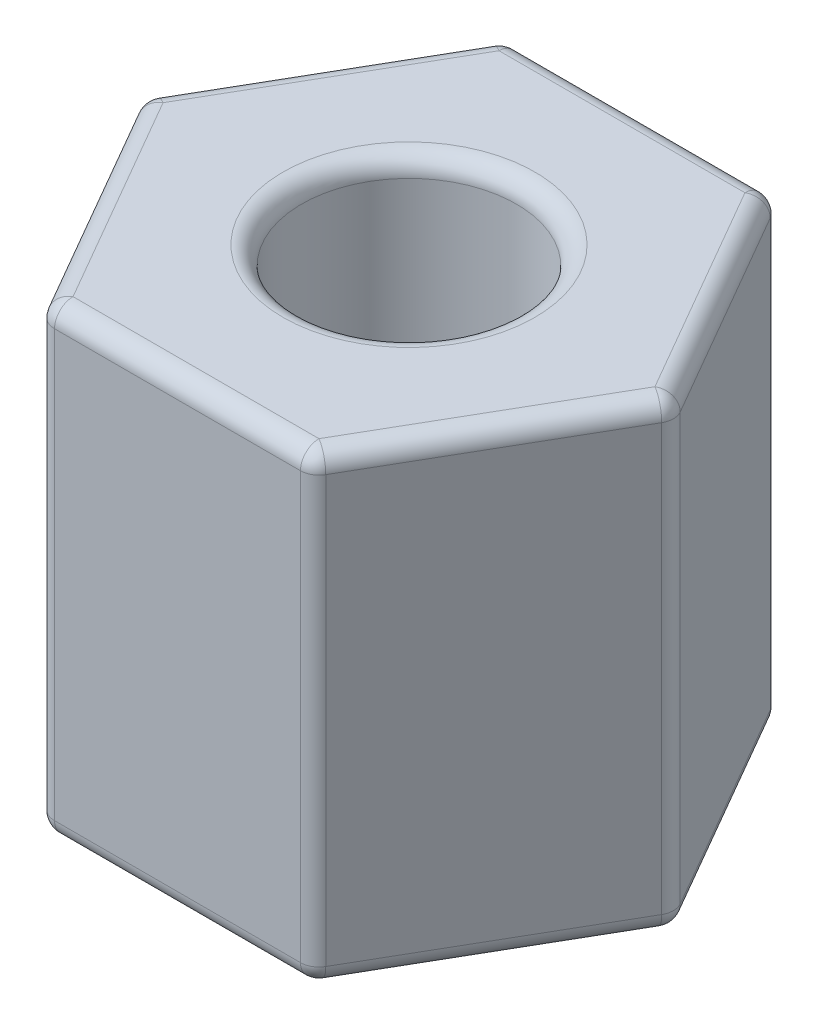
ISO-10303-21;
HEADER;
FILE_DESCRIPTION(('STEP AP214'),'2;1');
FILE_NAME('part.step','',(''),(''),'','','');
FILE_SCHEMA(('AUTOMOTIVE_DESIGN { 1 0 10303 214 1 1 1 1 }'));
ENDSEC;
DATA;
#1=APPLICATION_CONTEXT('core data for automotive mechanical design processes');
#2=APPLICATION_PROTOCOL_DEFINITION('international standard','automotive_design',2000,#1);
#3=PRODUCT_CONTEXT('',#1,'mechanical');
#4=PRODUCT('Part','Part','',(#3));
#5=PRODUCT_RELATED_PRODUCT_CATEGORY('part','',(#4));
#6=PRODUCT_DEFINITION_FORMATION('','',#4);
#7=PRODUCT_DEFINITION_CONTEXT('part definition',#1,'design');
#8=PRODUCT_DEFINITION('design','',#6,#7);
#9=PRODUCT_DEFINITION_SHAPE('','',#8);
#10=(LENGTH_UNIT() NAMED_UNIT(*) SI_UNIT(.MILLI.,.METRE.));
#11=(NAMED_UNIT(*) PLANE_ANGLE_UNIT() SI_UNIT($,.RADIAN.));
#12=(NAMED_UNIT(*) SI_UNIT($,.STERADIAN.) SOLID_ANGLE_UNIT());
#13=UNCERTAINTY_MEASURE_WITH_UNIT(LENGTH_MEASURE(1.E-05),#10,'distance_accuracy_value','');
#14=(GEOMETRIC_REPRESENTATION_CONTEXT(3) GLOBAL_UNCERTAINTY_ASSIGNED_CONTEXT((#13)) GLOBAL_UNIT_ASSIGNED_CONTEXT((#10,
#11,#12)) REPRESENTATION_CONTEXT('',''));
#15=CARTESIAN_POINT('',(0.,0.,0.));
#16=DIRECTION('',(0.,0.,1.));
#17=DIRECTION('',(1.,0.,0.));
#18=AXIS2_PLACEMENT_3D('',#15,#16,#17);
#19=CARTESIAN_POINT('',(0.,6.35,0.));
#20=DIRECTION('',(0.,1.,0.));
#21=DIRECTION('',(0.,0.,1.));
#22=AXIS2_PLACEMENT_3D('',#19,#20,#21);
#23=PLANE('',#22);
#24=CARTESIAN_POINT('',(0.,6.35,0.));
#25=DIRECTION('',(0.,1.,0.));
#26=DIRECTION('',(0.,0.,1.));
#27=AXIS2_PLACEMENT_3D('',#24,#25,#26);
#28=CIRCLE('',#27,1.7272);
#29=CARTESIAN_POINT('',(0.,6.35,1.7272));
#30=VERTEX_POINT('',#29);
#31=EDGE_CURVE('E229',#30,#30,#28,.F.);
#32=ORIENTED_EDGE('',*,*,#31,.T.);
#33=EDGE_LOOP('',(#32));
#34=FACE_BOUND('',#33,.T.);
#35=DIRECTION('',(0.5,0.,-0.866025403784439));
#36=VECTOR('',#35,1.);
#37=CARTESIAN_POINT('',(3.44620375679286,6.35,-0.126999999999994));
#38=LINE('',#37,#36);
#39=CARTESIAN_POINT('',(1.68644013630289,6.35,2.92099999999999));
#40=VERTEX_POINT('',#39);
#41=CARTESIAN_POINT('',(3.37288027260578,6.35,0.));
#42=VERTEX_POINT('',#41);
#43=EDGE_CURVE('E163',#40,#42,#38,.T.);
#44=ORIENTED_EDGE('',*,*,#43,.T.);
#45=DIRECTION('',(-0.5,0.,-0.866025403784439));
#46=VECTOR('',#45,1.);
#47=CARTESIAN_POINT('',(1.61311665211579,6.35,-3.04800000000001));
#48=LINE('',#47,#46);
#49=CARTESIAN_POINT('',(1.68644013630288,6.35,-2.92100000000001));
#50=VERTEX_POINT('',#49);
#51=EDGE_CURVE('E227',#42,#50,#48,.T.);
#52=ORIENTED_EDGE('',*,*,#51,.T.);
#53=DIRECTION('',(-1.,0.,0.));
#54=VECTOR('',#53,1.);
#55=CARTESIAN_POINT('',(-1.83308710467707,6.35,-2.92100000000001));
#56=LINE('',#55,#54);
#57=CARTESIAN_POINT('',(-1.6864401363029,6.35,-2.92100000000001));
#58=VERTEX_POINT('',#57);
#59=EDGE_CURVE('E225',#50,#58,#56,.T.);
#60=ORIENTED_EDGE('',*,*,#59,.T.);
#61=DIRECTION('',(-0.5,0.,0.866025403784439));
#62=VECTOR('',#61,1.);
#63=CARTESIAN_POINT('',(-3.44620375679288,6.35,0.126999999999989));
#64=LINE('',#63,#62);
#65=CARTESIAN_POINT('',(-3.3728802726058,6.35,0.));
#66=VERTEX_POINT('',#65);
#67=EDGE_CURVE('E223',#58,#66,#64,.T.);
#68=ORIENTED_EDGE('',*,*,#67,.T.);
#69=DIRECTION('',(0.5,0.,0.866025403784439));
#70=VECTOR('',#69,1.);
#71=CARTESIAN_POINT('',(-1.61311665211581,6.35,3.048));
#72=LINE('',#71,#70);
#73=CARTESIAN_POINT('',(-1.6864401363029,6.35,2.921));
#74=VERTEX_POINT('',#73);
#75=EDGE_CURVE('E166',#66,#74,#72,.T.);
#76=ORIENTED_EDGE('',*,*,#75,.T.);
#77=DIRECTION('',(1.,0.,0.));
#78=VECTOR('',#77,1.);
#79=CARTESIAN_POINT('',(1.83308710467706,6.35,2.92099999999999));
#80=LINE('',#79,#78);
#81=EDGE_CURVE('E160',#74,#40,#80,.T.);
#82=ORIENTED_EDGE('',*,*,#81,.T.);
#83=EDGE_LOOP('',(#44,#52,#60,#68,#76,#82));
#84=FACE_BOUND('',#83,.T.);
#85=ADVANCED_FACE('F33',(#34,#84),#23,.T.);
#86=CARTESIAN_POINT('',(0.,0.,0.));
#87=DIRECTION('',(0.,1.,0.));
#88=DIRECTION('',(0.,0.,1.));
#89=AXIS2_PLACEMENT_3D('',#86,#87,#88);
#90=PLANE('',#89);
#91=CARTESIAN_POINT('',(0.,0.,0.));
#92=DIRECTION('',(0.,1.,0.));
#93=DIRECTION('',(0.,0.,1.));
#94=AXIS2_PLACEMENT_3D('',#91,#92,#93);
#95=CIRCLE('',#94,1.7272);
#96=CARTESIAN_POINT('',(0.,0.,1.7272));
#97=VERTEX_POINT('',#96);
#98=EDGE_CURVE('E245',#97,#97,#95,.T.);
#99=ORIENTED_EDGE('',*,*,#98,.T.);
#100=EDGE_LOOP('',(#99));
#101=FACE_BOUND('',#100,.T.);
#102=DIRECTION('',(0.5,0.,0.866025403784439));
#103=VECTOR('',#102,1.);
#104=CARTESIAN_POINT('',(-2.52966020445434,0.,1.4605));
#105=LINE('',#104,#103);
#106=CARTESIAN_POINT('',(-1.6864401363029,0.,2.921));
#107=VERTEX_POINT('',#106);
#108=CARTESIAN_POINT('',(-3.3728802726058,0.,0.));
#109=VERTEX_POINT('',#108);
#110=EDGE_CURVE('E232',#107,#109,#105,.F.);
#111=ORIENTED_EDGE('',*,*,#110,.T.);
#112=DIRECTION('',(-0.5,0.,0.866025403784439));
#113=VECTOR('',#112,1.);
#114=CARTESIAN_POINT('',(-2.52966020445435,0.,-1.46050000000001));
#115=LINE('',#114,#113);
#116=CARTESIAN_POINT('',(-1.6864401363029,0.,-2.92100000000001));
#117=VERTEX_POINT('',#116);
#118=EDGE_CURVE('E242',#109,#117,#115,.F.);
#119=ORIENTED_EDGE('',*,*,#118,.T.);
#120=DIRECTION('',(-1.,0.,0.));
#121=VECTOR('',#120,1.);
#122=CARTESIAN_POINT('',(0.,0.,-2.92100000000001));
#123=LINE('',#122,#121);
#124=CARTESIAN_POINT('',(1.68644013630288,0.,-2.92100000000001));
#125=VERTEX_POINT('',#124);
#126=EDGE_CURVE('E240',#117,#125,#123,.F.);
#127=ORIENTED_EDGE('',*,*,#126,.T.);
#128=DIRECTION('',(-0.5,0.,-0.866025403784439));
#129=VECTOR('',#128,1.);
#130=CARTESIAN_POINT('',(2.52966020445433,0.,-1.46049999999999));
#131=LINE('',#130,#129);
#132=CARTESIAN_POINT('',(3.37288027260578,0.,0.));
#133=VERTEX_POINT('',#132);
#134=EDGE_CURVE('E238',#125,#133,#131,.F.);
#135=ORIENTED_EDGE('',*,*,#134,.T.);
#136=DIRECTION('',(0.5,0.,-0.866025403784439));
#137=VECTOR('',#136,1.);
#138=CARTESIAN_POINT('',(2.52966020445434,0.,1.4605));
#139=LINE('',#138,#137);
#140=CARTESIAN_POINT('',(1.68644013630289,0.,2.92099999999999));
#141=VERTEX_POINT('',#140);
#142=EDGE_CURVE('E236',#133,#141,#139,.F.);
#143=ORIENTED_EDGE('',*,*,#142,.T.);
#144=DIRECTION('',(1.,0.,0.));
#145=VECTOR('',#144,1.);
#146=CARTESIAN_POINT('',(0.,0.,2.921));
#147=LINE('',#146,#145);
#148=EDGE_CURVE('E234',#141,#107,#147,.F.);
#149=ORIENTED_EDGE('',*,*,#148,.T.);
#150=EDGE_LOOP('',(#111,#119,#127,#135,#143,#149));
#151=FACE_BOUND('',#150,.T.);
#152=ADVANCED_FACE('F429',(#101,#151),#90,.F.);
#153=CARTESIAN_POINT('',(-1.83308710467706,6.35,3.175));
#154=DIRECTION('',(0.,0.,-1.));
#155=DIRECTION('',(-1.,0.,0.));
#156=AXIS2_PLACEMENT_3D('',#153,#154,#155);
#157=PLANE('',#156);
#158=DIRECTION('',(0.,-1.,0.));
#159=VECTOR('',#158,1.);
#160=CARTESIAN_POINT('',(-1.6864401363029,6.35,3.175));
#161=LINE('',#160,#159);
#162=CARTESIAN_POINT('',(-1.6864401363029,6.096,3.175));
#163=VERTEX_POINT('',#162);
#164=CARTESIAN_POINT('',(-1.6864401363029,0.254,3.175));
#165=VERTEX_POINT('',#164);
#166=EDGE_CURVE('E284',#163,#165,#161,.T.);
#167=ORIENTED_EDGE('',*,*,#166,.T.);
#168=DIRECTION('',(1.,0.,0.));
#169=VECTOR('',#168,1.);
#170=CARTESIAN_POINT('',(-1.83308710467706,0.254,3.175));
#171=LINE('',#170,#169);
#172=CARTESIAN_POINT('',(1.68644013630289,0.254,3.17499999999999));
#173=VERTEX_POINT('',#172);
#174=EDGE_CURVE('E286',#165,#173,#171,.T.);
#175=ORIENTED_EDGE('',*,*,#174,.T.);
#176=DIRECTION('',(0.,-1.,0.));
#177=VECTOR('',#176,1.);
#178=CARTESIAN_POINT('',(1.68644013630289,6.35,3.17499999999999));
#179=LINE('',#178,#177);
#180=CARTESIAN_POINT('',(1.68644013630289,6.096,3.17499999999999));
#181=VERTEX_POINT('',#180);
#182=EDGE_CURVE('E282',#173,#181,#179,.F.);
#183=ORIENTED_EDGE('',*,*,#182,.T.);
#184=DIRECTION('',(1.,0.,0.));
#185=VECTOR('',#184,1.);
#186=CARTESIAN_POINT('',(-1.83308710467706,6.096,3.175));
#187=LINE('',#186,#185);
#188=EDGE_CURVE('E192',#181,#163,#187,.F.);
#189=ORIENTED_EDGE('',*,*,#188,.T.);
#190=EDGE_LOOP('',(#167,#175,#183,#189));
#191=FACE_BOUND('',#190,.T.);
#192=ADVANCED_FACE('F466',(#191),#157,.F.);
#193=CARTESIAN_POINT('',(1.83308710467706,6.35,3.17499999999999));
#194=DIRECTION('',(-0.866025403784439,0.,-0.5));
#195=DIRECTION('',(-0.5,0.,0.866025403784439));
#196=AXIS2_PLACEMENT_3D('',#193,#194,#195);
#197=PLANE('',#196);
#198=DIRECTION('',(0.,-1.,0.));
#199=VECTOR('',#198,1.);
#200=CARTESIAN_POINT('',(1.90641058886414,6.35,3.04799999999999));
#201=LINE('',#200,#199);
#202=CARTESIAN_POINT('',(1.90641058886414,6.096,3.04799999999999));
#203=VERTEX_POINT('',#202);
#204=CARTESIAN_POINT('',(1.90641058886414,0.254,3.04799999999999));
#205=VERTEX_POINT('',#204);
#206=EDGE_CURVE('E276',#203,#205,#201,.T.);
#207=ORIENTED_EDGE('',*,*,#206,.T.);
#208=DIRECTION('',(0.5,0.,-0.866025403784439));
#209=VECTOR('',#208,1.);
#210=CARTESIAN_POINT('',(1.83308710467706,0.254,3.17499999999999));
#211=LINE('',#210,#209);
#212=CARTESIAN_POINT('',(3.59285072516703,0.254,0.127000000000007));
#213=VERTEX_POINT('',#212);
#214=EDGE_CURVE('E279',#205,#213,#211,.T.);
#215=ORIENTED_EDGE('',*,*,#214,.T.);
#216=DIRECTION('',(0.,-1.,0.));
#217=VECTOR('',#216,1.);
#218=CARTESIAN_POINT('',(3.59285072516703,6.35,0.127000000000006));
#219=LINE('',#218,#217);
#220=CARTESIAN_POINT('',(3.59285072516703,6.096,0.127000000000007));
#221=VERTEX_POINT('',#220);
#222=EDGE_CURVE('E208',#213,#221,#219,.F.);
#223=ORIENTED_EDGE('',*,*,#222,.T.);
#224=DIRECTION('',(0.5,0.,-0.866025403784439));
#225=VECTOR('',#224,1.);
#226=CARTESIAN_POINT('',(1.83308710467706,6.096,3.17499999999999));
#227=LINE('',#226,#225);
#228=EDGE_CURVE('E274',#221,#203,#227,.F.);
#229=ORIENTED_EDGE('',*,*,#228,.T.);
#230=EDGE_LOOP('',(#207,#215,#223,#229));
#231=FACE_BOUND('',#230,.T.);
#232=ADVANCED_FACE('F605',(#231),#197,.F.);
#233=CARTESIAN_POINT('',(3.66617420935411,6.35,0.));
#234=DIRECTION('',(-0.866025403784439,0.,0.5));
#235=DIRECTION('',(0.5,0.,0.866025403784439));
#236=AXIS2_PLACEMENT_3D('',#233,#234,#235);
#237=PLANE('',#236);
#238=DIRECTION('',(0.,-1.,0.));
#239=VECTOR('',#238,1.);
#240=CARTESIAN_POINT('',(3.59285072516703,6.35,-0.126999999999994));
#241=LINE('',#240,#239);
#242=CARTESIAN_POINT('',(3.59285072516703,6.096,-0.126999999999994));
#243=VERTEX_POINT('',#242);
#244=CARTESIAN_POINT('',(3.59285072516703,0.254,-0.126999999999994));
#245=VERTEX_POINT('',#244);
#246=EDGE_CURVE('E210',#243,#245,#241,.T.);
#247=ORIENTED_EDGE('',*,*,#246,.T.);
#248=DIRECTION('',(-0.5,0.,-0.866025403784439));
#249=VECTOR('',#248,1.);
#250=CARTESIAN_POINT('',(3.66617420935411,0.254,0.));
#251=LINE('',#250,#249);
#252=CARTESIAN_POINT('',(1.90641058886412,0.254,-3.04800000000001));
#253=VERTEX_POINT('',#252);
#254=EDGE_CURVE('E271',#245,#253,#251,.T.);
#255=ORIENTED_EDGE('',*,*,#254,.T.);
#256=DIRECTION('',(0.,-1.,0.));
#257=VECTOR('',#256,1.);
#258=CARTESIAN_POINT('',(1.90641058886412,6.35,-3.04800000000001));
#259=LINE('',#258,#257);
#260=CARTESIAN_POINT('',(1.90641058886412,6.096,-3.04800000000001));
#261=VERTEX_POINT('',#260);
#262=EDGE_CURVE('E269',#253,#261,#259,.F.);
#263=ORIENTED_EDGE('',*,*,#262,.T.);
#264=DIRECTION('',(-0.5,0.,-0.866025403784439));
#265=VECTOR('',#264,1.);
#266=CARTESIAN_POINT('',(3.66617420935411,6.096,0.));
#267=LINE('',#266,#265);
#268=EDGE_CURVE('E266',#261,#243,#267,.F.);
#269=ORIENTED_EDGE('',*,*,#268,.T.);
#270=EDGE_LOOP('',(#247,#255,#263,#269));
#271=FACE_BOUND('',#270,.T.);
#272=ADVANCED_FACE('F384',(#271),#237,.F.);
#273=CARTESIAN_POINT('',(1.83308710467704,6.35,-3.17500000000001));
#274=DIRECTION('',(0.,0.,1.));
#275=DIRECTION('',(1.,0.,0.));
#276=AXIS2_PLACEMENT_3D('',#273,#274,#275);
#277=PLANE('',#276);
#278=DIRECTION('',(0.,-1.,0.));
#279=VECTOR('',#278,1.);
#280=CARTESIAN_POINT('',(1.68644013630288,6.35,-3.17500000000001));
#281=LINE('',#280,#279);
#282=CARTESIAN_POINT('',(1.68644013630288,6.096,-3.17500000000001));
#283=VERTEX_POINT('',#282);
#284=CARTESIAN_POINT('',(1.68644013630288,0.254,-3.17500000000001));
#285=VERTEX_POINT('',#284);
#286=EDGE_CURVE('E259',#283,#285,#281,.T.);
#287=ORIENTED_EDGE('',*,*,#286,.T.);
#288=DIRECTION('',(-1.,0.,0.));
#289=VECTOR('',#288,1.);
#290=CARTESIAN_POINT('',(1.83308710467704,0.254,-3.17500000000001));
#291=LINE('',#290,#289);
#292=CARTESIAN_POINT('',(-1.6864401363029,0.254,-3.17500000000001));
#293=VERTEX_POINT('',#292);
#294=EDGE_CURVE('E263',#285,#293,#291,.T.);
#295=ORIENTED_EDGE('',*,*,#294,.T.);
#296=DIRECTION('',(0.,-1.,0.));
#297=VECTOR('',#296,1.);
#298=CARTESIAN_POINT('',(-1.6864401363029,6.35,-3.17500000000001));
#299=LINE('',#298,#297);
#300=CARTESIAN_POINT('',(-1.6864401363029,6.096,-3.17500000000001));
#301=VERTEX_POINT('',#300);
#302=EDGE_CURVE('E261',#293,#301,#299,.F.);
#303=ORIENTED_EDGE('',*,*,#302,.T.);
#304=DIRECTION('',(-1.,0.,0.));
#305=VECTOR('',#304,1.);
#306=CARTESIAN_POINT('',(1.83308710467704,6.096,-3.17500000000001));
#307=LINE('',#306,#305);
#308=EDGE_CURVE('E257',#301,#283,#307,.F.);
#309=ORIENTED_EDGE('',*,*,#308,.T.);
#310=EDGE_LOOP('',(#287,#295,#303,#309));
#311=FACE_BOUND('',#310,.T.);
#312=ADVANCED_FACE('F457',(#311),#277,.F.);
#313=CARTESIAN_POINT('',(-1.83308710467707,6.35,-3.17500000000001));
#314=DIRECTION('',(0.866025403784439,0.,0.5));
#315=DIRECTION('',(0.5,0.,-0.866025403784439));
#316=AXIS2_PLACEMENT_3D('',#313,#314,#315);
#317=PLANE('',#316);
#318=DIRECTION('',(0.,-1.,0.));
#319=VECTOR('',#318,1.);
#320=CARTESIAN_POINT('',(-1.90641058886415,6.35,-3.04800000000001));
#321=LINE('',#320,#319);
#322=CARTESIAN_POINT('',(-1.90641058886415,6.096,-3.04800000000001));
#323=VERTEX_POINT('',#322);
#324=CARTESIAN_POINT('',(-1.90641058886415,0.254,-3.04800000000001));
#325=VERTEX_POINT('',#324);
#326=EDGE_CURVE('E250',#323,#325,#321,.T.);
#327=ORIENTED_EDGE('',*,*,#326,.T.);
#328=DIRECTION('',(-0.5,0.,0.866025403784439));
#329=VECTOR('',#328,1.);
#330=CARTESIAN_POINT('',(-1.83308710467707,0.254,-3.17500000000001));
#331=LINE('',#330,#329);
#332=CARTESIAN_POINT('',(-3.59285072516705,0.254,-0.127000000000011));
#333=VERTEX_POINT('',#332);
#334=EDGE_CURVE('E254',#325,#333,#331,.T.);
#335=ORIENTED_EDGE('',*,*,#334,.T.);
#336=DIRECTION('',(0.,-1.,0.));
#337=VECTOR('',#336,1.);
#338=CARTESIAN_POINT('',(-3.59285072516705,6.35,-0.127000000000011));
#339=LINE('',#338,#337);
#340=CARTESIAN_POINT('',(-3.59285072516705,6.096,-0.127000000000011));
#341=VERTEX_POINT('',#340);
#342=EDGE_CURVE('E252',#333,#341,#339,.F.);
#343=ORIENTED_EDGE('',*,*,#342,.T.);
#344=DIRECTION('',(-0.5,0.,0.866025403784439));
#345=VECTOR('',#344,1.);
#346=CARTESIAN_POINT('',(-1.83308710467707,6.096,-3.17500000000001));
#347=LINE('',#346,#345);
#348=EDGE_CURVE('E248',#341,#323,#347,.F.);
#349=ORIENTED_EDGE('',*,*,#348,.T.);
#350=EDGE_LOOP('',(#327,#335,#343,#349));
#351=FACE_BOUND('',#350,.T.);
#352=ADVANCED_FACE('F410',(#351),#317,.F.);
#353=CARTESIAN_POINT('',(-3.66617420935413,6.35,0.));
#354=DIRECTION('',(0.866025403784438,0.,-0.5));
#355=DIRECTION('',(-0.5,0.,-0.866025403784439));
#356=AXIS2_PLACEMENT_3D('',#353,#354,#355);
#357=PLANE('',#356);
#358=DIRECTION('',(0.,-1.,0.));
#359=VECTOR('',#358,1.);
#360=CARTESIAN_POINT('',(-3.59285072516705,6.35,0.126999999999989));
#361=LINE('',#360,#359);
#362=CARTESIAN_POINT('',(-3.59285072516705,6.096,0.126999999999989));
#363=VERTEX_POINT('',#362);
#364=CARTESIAN_POINT('',(-3.59285072516705,0.254,0.126999999999989));
#365=VERTEX_POINT('',#364);
#366=EDGE_CURVE('E57',#363,#365,#361,.T.);
#367=ORIENTED_EDGE('',*,*,#366,.T.);
#368=DIRECTION('',(0.5,0.,0.866025403784439));
#369=VECTOR('',#368,1.);
#370=CARTESIAN_POINT('',(-3.66617420935413,0.254,0.));
#371=LINE('',#370,#369);
#372=CARTESIAN_POINT('',(-1.90641058886414,0.254,3.048));
#373=VERTEX_POINT('',#372);
#374=EDGE_CURVE('E11',#365,#373,#371,.T.);
#375=ORIENTED_EDGE('',*,*,#374,.T.);
#376=DIRECTION('',(0.,-1.,0.));
#377=VECTOR('',#376,1.);
#378=CARTESIAN_POINT('',(-1.90641058886414,6.35,3.048));
#379=LINE('',#378,#377);
#380=CARTESIAN_POINT('',(-1.90641058886414,6.096,3.048));
#381=VERTEX_POINT('',#380);
#382=EDGE_CURVE('E42',#373,#381,#379,.F.);
#383=ORIENTED_EDGE('',*,*,#382,.T.);
#384=DIRECTION('',(0.5,0.,0.866025403784439));
#385=VECTOR('',#384,1.);
#386=CARTESIAN_POINT('',(-3.66617420935413,6.096,0.));
#387=LINE('',#386,#385);
#388=EDGE_CURVE('E289',#381,#363,#387,.F.);
#389=ORIENTED_EDGE('',*,*,#388,.T.);
#390=EDGE_LOOP('',(#367,#375,#383,#389));
#391=FACE_BOUND('',#390,.T.);
#392=ADVANCED_FACE('F446',(#391),#357,.F.);
#393=CARTESIAN_POINT('',(0.,6.35,0.));
#394=DIRECTION('',(0.,-1.,0.));
#395=DIRECTION('',(0.,0.,-1.));
#396=AXIS2_PLACEMENT_3D('',#393,#394,#395);
#397=CYLINDRICAL_SURFACE('',#396,1.4732);
#398=CARTESIAN_POINT('',(0.,6.096,0.));
#399=DIRECTION('',(0.,1.,0.));
#400=DIRECTION('',(0.,0.,1.));
#401=AXIS2_PLACEMENT_3D('',#398,#399,#400);
#402=CIRCLE('',#401,1.4732);
#403=CARTESIAN_POINT('',(0.,6.096,1.4732));
#404=VERTEX_POINT('',#403);
#405=EDGE_CURVE('E180',#404,#404,#402,.T.);
#406=ORIENTED_EDGE('',*,*,#405,.T.);
#407=EDGE_LOOP('',(#406));
#408=FACE_BOUND('',#407,.T.);
#409=CARTESIAN_POINT('',(0.,0.254,0.));
#410=DIRECTION('',(0.,1.,0.));
#411=DIRECTION('',(0.,0.,1.));
#412=AXIS2_PLACEMENT_3D('',#409,#410,#411);
#413=CIRCLE('',#412,1.4732);
#414=CARTESIAN_POINT('',(0.,0.254,1.4732));
#415=VERTEX_POINT('',#414);
#416=EDGE_CURVE('E214',#415,#415,#413,.F.);
#417=ORIENTED_EDGE('',*,*,#416,.T.);
#418=EDGE_LOOP('',(#417));
#419=FACE_BOUND('',#418,.T.);
#420=ADVANCED_FACE('F448',(#408,#419),#397,.F.);
#421=CARTESIAN_POINT('',(0.,6.096,0.));
#422=DIRECTION('',(0.,1.,0.));
#423=DIRECTION('',(0.,0.,1.));
#424=AXIS2_PLACEMENT_3D('',#421,#422,#423);
#425=TOROIDAL_SURFACE('',#424,1.7272,0.254);
#426=ORIENTED_EDGE('',*,*,#31,.F.);
#427=EDGE_LOOP('',(#426));
#428=FACE_BOUND('',#427,.T.);
#429=ORIENTED_EDGE('',*,*,#405,.F.);
#430=EDGE_LOOP('',(#429));
#431=FACE_BOUND('',#430,.T.);
#432=ADVANCED_FACE('F454',(#428,#431),#425,.T.);
#433=CARTESIAN_POINT('',(0.,0.254,0.));
#434=DIRECTION('',(0.,1.,0.));
#435=DIRECTION('',(0.,0.,1.));
#436=AXIS2_PLACEMENT_3D('',#433,#434,#435);
#437=TOROIDAL_SURFACE('',#436,1.7272,0.254);
#438=ORIENTED_EDGE('',*,*,#416,.F.);
#439=EDGE_LOOP('',(#438));
#440=FACE_BOUND('',#439,.T.);
#441=ORIENTED_EDGE('',*,*,#98,.F.);
#442=EDGE_LOOP('',(#441));
#443=FACE_BOUND('',#442,.T.);
#444=ADVANCED_FACE('F472',(#440,#443),#437,.T.);
#445=CARTESIAN_POINT('',(2.52966020445434,6.096,1.4605));
#446=DIRECTION('',(-0.5,0.,0.866025403784439));
#447=DIRECTION('',(0.866025403784439,0.,0.5));
#448=AXIS2_PLACEMENT_3D('',#445,#446,#447);
#449=CYLINDRICAL_SURFACE('',#448,0.254);
#450=CARTESIAN_POINT('',(3.37288027260578,6.096,0.));
#451=DIRECTION('',(0.499999999999999,0.,-0.866025403784439));
#452=DIRECTION('',(-0.866025403784439,0.,-0.499999999999999));
#453=AXIS2_PLACEMENT_3D('',#450,#451,#452);
#454=CIRCLE('',#453,0.254);
#455=EDGE_CURVE('E37',#42,#221,#454,.T.);
#456=ORIENTED_EDGE('',*,*,#455,.F.);
#457=ORIENTED_EDGE('',*,*,#43,.F.);
#458=CARTESIAN_POINT('',(1.68644013630289,6.096,2.92099999999999));
#459=DIRECTION('',(-0.5,0.,0.866025403784439));
#460=DIRECTION('',(0.866025403784439,0.,0.5));
#461=AXIS2_PLACEMENT_3D('',#458,#459,#460);
#462=CIRCLE('',#461,0.254);
#463=EDGE_CURVE('E176',#203,#40,#462,.T.);
#464=ORIENTED_EDGE('',*,*,#463,.F.);
#465=ORIENTED_EDGE('',*,*,#228,.F.);
#466=EDGE_LOOP('',(#456,#457,#464,#465));
#467=FACE_BOUND('',#466,.T.);
#468=ADVANCED_FACE('F35',(#467),#449,.T.);
#469=CARTESIAN_POINT('',(3.37288027260578,6.096,0.));
#470=DIRECTION('',(0.,0.,1.));
#471=DIRECTION('',(1.,0.,0.));
#472=AXIS2_PLACEMENT_3D('',#469,#470,#471);
#473=SPHERICAL_SURFACE('',#472,0.254);
#474=CARTESIAN_POINT('',(3.37288027260578,6.096,0.));
#475=DIRECTION('',(0.5,0.,0.866025403784439));
#476=DIRECTION('',(0.866025403784439,0.,-0.5));
#477=AXIS2_PLACEMENT_3D('',#474,#475,#476);
#478=CIRCLE('',#477,0.254);
#479=EDGE_CURVE('E193',#42,#243,#478,.F.);
#480=ORIENTED_EDGE('',*,*,#479,.F.);
#481=ORIENTED_EDGE('',*,*,#455,.T.);
#482=CARTESIAN_POINT('',(3.37288027260578,6.096,0.));
#483=DIRECTION('',(0.,1.,0.));
#484=DIRECTION('',(0.,0.,1.));
#485=AXIS2_PLACEMENT_3D('',#482,#483,#484);
#486=CIRCLE('',#485,0.254);
#487=EDGE_CURVE('E190',#243,#221,#486,.F.);
#488=ORIENTED_EDGE('',*,*,#487,.F.);
#489=EDGE_LOOP('',(#480,#481,#488));
#490=FACE_BOUND('',#489,.T.);
#491=ADVANCED_FACE('F212',(#490),#473,.T.);
#492=CARTESIAN_POINT('',(1.68644013630289,6.096,2.92099999999999));
#493=DIRECTION('',(0.,0.,1.));
#494=DIRECTION('',(1.,0.,0.));
#495=AXIS2_PLACEMENT_3D('',#492,#493,#494);
#496=SPHERICAL_SURFACE('',#495,0.254);
#497=CARTESIAN_POINT('',(1.68644013630289,6.096,2.92099999999999));
#498=DIRECTION('',(0.,1.,0.));
#499=DIRECTION('',(0.,0.,1.));
#500=AXIS2_PLACEMENT_3D('',#497,#498,#499);
#501=CIRCLE('',#500,0.254);
#502=EDGE_CURVE('E188',#203,#181,#501,.F.);
#503=ORIENTED_EDGE('',*,*,#502,.F.);
#504=ORIENTED_EDGE('',*,*,#463,.T.);
#505=CARTESIAN_POINT('',(1.68644013630289,6.096,2.92099999999999));
#506=DIRECTION('',(1.,0.,0.));
#507=DIRECTION('',(0.,0.,-1.));
#508=AXIS2_PLACEMENT_3D('',#505,#506,#507);
#509=CIRCLE('',#508,0.254);
#510=EDGE_CURVE('E185',#181,#40,#509,.F.);
#511=ORIENTED_EDGE('',*,*,#510,.F.);
#512=EDGE_LOOP('',(#503,#504,#511));
#513=FACE_BOUND('',#512,.T.);
#514=ADVANCED_FACE('F184',(#513),#496,.T.);
#515=CARTESIAN_POINT('',(3.37288027260578,6.35,0.));
#516=DIRECTION('',(0.,-1.,0.));
#517=DIRECTION('',(0.,0.,-1.));
#518=AXIS2_PLACEMENT_3D('',#515,#516,#517);
#519=CYLINDRICAL_SURFACE('',#518,0.254);
#520=ORIENTED_EDGE('',*,*,#487,.T.);
#521=ORIENTED_EDGE('',*,*,#222,.F.);
#522=CARTESIAN_POINT('',(3.37288027260578,0.254,0.));
#523=DIRECTION('',(0.,-1.,0.));
#524=DIRECTION('',(0.,0.,-1.));
#525=AXIS2_PLACEMENT_3D('',#522,#523,#524);
#526=CIRCLE('',#525,0.254);
#527=EDGE_CURVE('E368',#245,#213,#526,.T.);
#528=ORIENTED_EDGE('',*,*,#527,.F.);
#529=ORIENTED_EDGE('',*,*,#246,.F.);
#530=EDGE_LOOP('',(#520,#521,#528,#529));
#531=FACE_BOUND('',#530,.T.);
#532=ADVANCED_FACE('F206',(#531),#519,.T.);
#533=CARTESIAN_POINT('',(2.52966020445433,6.096,-1.46049999999999));
#534=DIRECTION('',(0.5,0.,0.866025403784439));
#535=DIRECTION('',(0.866025403784439,0.,-0.5));
#536=AXIS2_PLACEMENT_3D('',#533,#534,#535);
#537=CYLINDRICAL_SURFACE('',#536,0.254);
#538=ORIENTED_EDGE('',*,*,#479,.T.);
#539=ORIENTED_EDGE('',*,*,#268,.F.);
#540=CARTESIAN_POINT('',(1.68644013630288,6.096,-2.92100000000001));
#541=DIRECTION('',(-0.5,0.,-0.866025403784439));
#542=DIRECTION('',(-0.866025403784439,0.,0.5));
#543=AXIS2_PLACEMENT_3D('',#540,#541,#542);
#544=CIRCLE('',#543,0.254);
#545=EDGE_CURVE('E365',#50,#261,#544,.T.);
#546=ORIENTED_EDGE('',*,*,#545,.F.);
#547=ORIENTED_EDGE('',*,*,#51,.F.);
#548=EDGE_LOOP('',(#538,#539,#546,#547));
#549=FACE_BOUND('',#548,.T.);
#550=ADVANCED_FACE('F388',(#549),#537,.T.);
#551=CARTESIAN_POINT('',(0.,6.096,2.921));
#552=DIRECTION('',(-1.,0.,0.));
#553=DIRECTION('',(0.,0.,1.));
#554=AXIS2_PLACEMENT_3D('',#551,#552,#553);
#555=CYLINDRICAL_SURFACE('',#554,0.254);
#556=ORIENTED_EDGE('',*,*,#510,.T.);
#557=ORIENTED_EDGE('',*,*,#81,.F.);
#558=CARTESIAN_POINT('',(-1.6864401363029,6.096,2.921));
#559=DIRECTION('',(-1.,0.,0.));
#560=DIRECTION('',(0.,-1.,0.));
#561=AXIS2_PLACEMENT_3D('',#558,#559,#560);
#562=CIRCLE('',#561,0.254);
#563=EDGE_CURVE('E363',#163,#74,#562,.T.);
#564=ORIENTED_EDGE('',*,*,#563,.F.);
#565=ORIENTED_EDGE('',*,*,#188,.F.);
#566=EDGE_LOOP('',(#556,#557,#564,#565));
#567=FACE_BOUND('',#566,.T.);
#568=ADVANCED_FACE('F191',(#567),#555,.T.);
#569=CARTESIAN_POINT('',(1.68644013630289,6.35,2.92099999999999));
#570=DIRECTION('',(0.,-1.,0.));
#571=DIRECTION('',(0.,0.,-1.));
#572=AXIS2_PLACEMENT_3D('',#569,#570,#571);
#573=CYLINDRICAL_SURFACE('',#572,0.254);
#574=ORIENTED_EDGE('',*,*,#502,.T.);
#575=ORIENTED_EDGE('',*,*,#182,.F.);
#576=CARTESIAN_POINT('',(1.68644013630289,0.254,2.92099999999999));
#577=DIRECTION('',(0.,-1.,0.));
#578=DIRECTION('',(0.,0.,-1.));
#579=AXIS2_PLACEMENT_3D('',#576,#577,#578);
#580=CIRCLE('',#579,0.254);
#581=EDGE_CURVE('E360',#205,#173,#580,.T.);
#582=ORIENTED_EDGE('',*,*,#581,.F.);
#583=ORIENTED_EDGE('',*,*,#206,.F.);
#584=EDGE_LOOP('',(#574,#575,#582,#583));
#585=FACE_BOUND('',#584,.T.);
#586=ADVANCED_FACE('F546',(#585),#573,.T.);
#587=CARTESIAN_POINT('',(1.61311665211581,0.254,3.04799999999999));
#588=DIRECTION('',(0.5,0.,-0.866025403784439));
#589=DIRECTION('',(-0.866025403784439,0.,-0.5));
#590=AXIS2_PLACEMENT_3D('',#587,#588,#589);
#591=CYLINDRICAL_SURFACE('',#590,0.254);
#592=CARTESIAN_POINT('',(3.37288027260578,0.254,0.));
#593=DIRECTION('',(0.5,0.,-0.866025403784439));
#594=DIRECTION('',(-0.866025403784439,0.,-0.5));
#595=AXIS2_PLACEMENT_3D('',#592,#593,#594);
#596=CIRCLE('',#595,0.254);
#597=EDGE_CURVE('E197',#213,#133,#596,.T.);
#598=ORIENTED_EDGE('',*,*,#597,.F.);
#599=ORIENTED_EDGE('',*,*,#214,.F.);
#600=CARTESIAN_POINT('',(1.68644013630289,0.254,2.92099999999999));
#601=DIRECTION('',(-0.5,0.,0.866025403784439));
#602=DIRECTION('',(0.866025403784439,0.,0.5));
#603=AXIS2_PLACEMENT_3D('',#600,#601,#602);
#604=CIRCLE('',#603,0.254);
#605=EDGE_CURVE('E357',#141,#205,#604,.T.);
#606=ORIENTED_EDGE('',*,*,#605,.F.);
#607=ORIENTED_EDGE('',*,*,#142,.F.);
#608=EDGE_LOOP('',(#598,#599,#606,#607));
#609=FACE_BOUND('',#608,.T.);
#610=ADVANCED_FACE('F543',(#609),#591,.T.);
#611=CARTESIAN_POINT('',(3.37288027260578,0.254,0.));
#612=DIRECTION('',(0.,0.,1.));
#613=DIRECTION('',(1.,0.,0.));
#614=AXIS2_PLACEMENT_3D('',#611,#612,#613);
#615=SPHERICAL_SURFACE('',#614,0.254);
#616=ORIENTED_EDGE('',*,*,#527,.T.);
#617=ORIENTED_EDGE('',*,*,#597,.T.);
#618=CARTESIAN_POINT('',(3.37288027260578,0.254,0.));
#619=DIRECTION('',(0.5,0.,0.866025403784439));
#620=DIRECTION('',(0.866025403784439,0.,-0.5));
#621=AXIS2_PLACEMENT_3D('',#618,#619,#620);
#622=CIRCLE('',#621,0.254);
#623=EDGE_CURVE('E354',#245,#133,#622,.F.);
#624=ORIENTED_EDGE('',*,*,#623,.F.);
#625=EDGE_LOOP('',(#616,#617,#624));
#626=FACE_BOUND('',#625,.T.);
#627=ADVANCED_FACE('F373',(#626),#615,.T.);
#628=CARTESIAN_POINT('',(1.68644013630288,6.096,-2.92100000000001));
#629=DIRECTION('',(0.,0.,1.));
#630=DIRECTION('',(1.,0.,0.));
#631=AXIS2_PLACEMENT_3D('',#628,#629,#630);
#632=SPHERICAL_SURFACE('',#631,0.254);
#633=CARTESIAN_POINT('',(1.68644013630288,6.096,-2.92100000000001));
#634=DIRECTION('',(1.,0.,0.));
#635=DIRECTION('',(0.,0.,-1.));
#636=AXIS2_PLACEMENT_3D('',#633,#634,#635);
#637=CIRCLE('',#636,0.254);
#638=EDGE_CURVE('E348',#50,#283,#637,.F.);
#639=ORIENTED_EDGE('',*,*,#638,.F.);
#640=ORIENTED_EDGE('',*,*,#545,.T.);
#641=CARTESIAN_POINT('',(1.68644013630288,6.096,-2.92100000000001));
#642=DIRECTION('',(0.,1.,0.));
#643=DIRECTION('',(0.,0.,1.));
#644=AXIS2_PLACEMENT_3D('',#641,#642,#643);
#645=CIRCLE('',#644,0.254);
#646=EDGE_CURVE('E351',#283,#261,#645,.F.);
#647=ORIENTED_EDGE('',*,*,#646,.F.);
#648=EDGE_LOOP('',(#639,#640,#647));
#649=FACE_BOUND('',#648,.T.);
#650=ADVANCED_FACE('F536',(#649),#632,.T.);
#651=CARTESIAN_POINT('',(-1.6864401363029,6.096,2.921));
#652=DIRECTION('',(0.,0.,1.));
#653=DIRECTION('',(1.,0.,0.));
#654=AXIS2_PLACEMENT_3D('',#651,#652,#653);
#655=SPHERICAL_SURFACE('',#654,0.254);
#656=CARTESIAN_POINT('',(-1.6864401363029,6.096,2.921));
#657=DIRECTION('',(0.,1.,0.));
#658=DIRECTION('',(0.,0.,1.));
#659=AXIS2_PLACEMENT_3D('',#656,#657,#658);
#660=CIRCLE('',#659,0.254);
#661=EDGE_CURVE('E342',#163,#381,#660,.F.);
#662=ORIENTED_EDGE('',*,*,#661,.F.);
#663=ORIENTED_EDGE('',*,*,#563,.T.);
#664=CARTESIAN_POINT('',(-1.6864401363029,6.096,2.921));
#665=DIRECTION('',(0.499999999999999,0.,0.866025403784439));
#666=DIRECTION('',(0.866025403784439,0.,-0.499999999999999));
#667=AXIS2_PLACEMENT_3D('',#664,#665,#666);
#668=CIRCLE('',#667,0.254);
#669=EDGE_CURVE('E345',#381,#74,#668,.F.);
#670=ORIENTED_EDGE('',*,*,#669,.F.);
#671=EDGE_LOOP('',(#662,#663,#670));
#672=FACE_BOUND('',#671,.T.);
#673=ADVANCED_FACE('F532',(#672),#655,.T.);
#674=CARTESIAN_POINT('',(1.68644013630289,0.254,2.92099999999999));
#675=DIRECTION('',(0.,0.,1.));
#676=DIRECTION('',(1.,0.,0.));
#677=AXIS2_PLACEMENT_3D('',#674,#675,#676);
#678=SPHERICAL_SURFACE('',#677,0.254);
#679=ORIENTED_EDGE('',*,*,#605,.T.);
#680=ORIENTED_EDGE('',*,*,#581,.T.);
#681=CARTESIAN_POINT('',(1.68644013630289,0.254,2.92099999999999));
#682=DIRECTION('',(1.,0.,0.));
#683=DIRECTION('',(0.,0.,-1.));
#684=AXIS2_PLACEMENT_3D('',#681,#682,#683);
#685=CIRCLE('',#684,0.254);
#686=EDGE_CURVE('E340',#141,#173,#685,.F.);
#687=ORIENTED_EDGE('',*,*,#686,.F.);
#688=EDGE_LOOP('',(#679,#680,#687));
#689=FACE_BOUND('',#688,.T.);
#690=ADVANCED_FACE('F529',(#689),#678,.T.);
#691=CARTESIAN_POINT('',(3.44620375679286,0.254,0.127000000000007));
#692=DIRECTION('',(-0.5,0.,-0.866025403784439));
#693=DIRECTION('',(-0.866025403784439,0.,0.5));
#694=AXIS2_PLACEMENT_3D('',#691,#692,#693);
#695=CYLINDRICAL_SURFACE('',#694,0.254);
#696=ORIENTED_EDGE('',*,*,#623,.T.);
#697=ORIENTED_EDGE('',*,*,#134,.F.);
#698=CARTESIAN_POINT('',(1.68644013630288,0.254,-2.92100000000001));
#699=DIRECTION('',(-0.5,0.,-0.866025403784439));
#700=DIRECTION('',(-0.866025403784439,0.,0.5));
#701=AXIS2_PLACEMENT_3D('',#698,#699,#700);
#702=CIRCLE('',#701,0.254);
#703=EDGE_CURVE('E337',#253,#125,#702,.T.);
#704=ORIENTED_EDGE('',*,*,#703,.F.);
#705=ORIENTED_EDGE('',*,*,#254,.F.);
#706=EDGE_LOOP('',(#696,#697,#704,#705));
#707=FACE_BOUND('',#706,.T.);
#708=ADVANCED_FACE('F380',(#707),#695,.T.);
#709=CARTESIAN_POINT('',(1.68644013630288,6.35,-2.92100000000001));
#710=DIRECTION('',(0.,-1.,0.));
#711=DIRECTION('',(0.,0.,-1.));
#712=AXIS2_PLACEMENT_3D('',#709,#710,#711);
#713=CYLINDRICAL_SURFACE('',#712,0.254);
#714=ORIENTED_EDGE('',*,*,#646,.T.);
#715=ORIENTED_EDGE('',*,*,#262,.F.);
#716=CARTESIAN_POINT('',(1.68644013630288,0.254,-2.92100000000001));
#717=DIRECTION('',(0.,-1.,0.));
#718=DIRECTION('',(0.,0.,-1.));
#719=AXIS2_PLACEMENT_3D('',#716,#717,#718);
#720=CIRCLE('',#719,0.254);
#721=EDGE_CURVE('E335',#285,#253,#720,.T.);
#722=ORIENTED_EDGE('',*,*,#721,.F.);
#723=ORIENTED_EDGE('',*,*,#286,.F.);
#724=EDGE_LOOP('',(#714,#715,#722,#723));
#725=FACE_BOUND('',#724,.T.);
#726=ADVANCED_FACE('F523',(#725),#713,.T.);
#727=CARTESIAN_POINT('',(0.,6.096,-2.92100000000001));
#728=DIRECTION('',(1.,0.,0.));
#729=DIRECTION('',(0.,0.,-1.));
#730=AXIS2_PLACEMENT_3D('',#727,#728,#729);
#731=CYLINDRICAL_SURFACE('',#730,0.254);
#732=ORIENTED_EDGE('',*,*,#638,.T.);
#733=ORIENTED_EDGE('',*,*,#308,.F.);
#734=CARTESIAN_POINT('',(-1.6864401363029,6.096,-2.92100000000001));
#735=DIRECTION('',(-1.,0.,0.));
#736=DIRECTION('',(0.,0.,1.));
#737=AXIS2_PLACEMENT_3D('',#734,#735,#736);
#738=CIRCLE('',#737,0.254);
#739=EDGE_CURVE('E332',#58,#301,#738,.T.);
#740=ORIENTED_EDGE('',*,*,#739,.F.);
#741=ORIENTED_EDGE('',*,*,#59,.F.);
#742=EDGE_LOOP('',(#732,#733,#740,#741));
#743=FACE_BOUND('',#742,.T.);
#744=ADVANCED_FACE('F400',(#743),#731,.T.);
#745=CARTESIAN_POINT('',(-2.52966020445435,6.096,-1.46050000000001));
#746=DIRECTION('',(0.5,0.,-0.866025403784439));
#747=DIRECTION('',(-0.866025403784439,0.,-0.5));
#748=AXIS2_PLACEMENT_3D('',#745,#746,#747);
#749=CYLINDRICAL_SURFACE('',#748,0.254);
#750=CARTESIAN_POINT('',(-3.3728802726058,6.096,0.));
#751=DIRECTION('',(-0.5,0.,0.866025403784439));
#752=DIRECTION('',(0.866025403784439,0.,0.5));
#753=AXIS2_PLACEMENT_3D('',#750,#751,#752);
#754=CIRCLE('',#753,0.254);
#755=EDGE_CURVE('E326',#66,#341,#754,.T.);
#756=ORIENTED_EDGE('',*,*,#755,.F.);
#757=ORIENTED_EDGE('',*,*,#67,.F.);
#758=CARTESIAN_POINT('',(-1.6864401363029,6.096,-2.92100000000001));
#759=DIRECTION('',(0.5,0.,-0.866025403784439));
#760=DIRECTION('',(-0.866025403784439,0.,-0.5));
#761=AXIS2_PLACEMENT_3D('',#758,#759,#760);
#762=CIRCLE('',#761,0.254);
#763=EDGE_CURVE('E329',#323,#58,#762,.T.);
#764=ORIENTED_EDGE('',*,*,#763,.F.);
#765=ORIENTED_EDGE('',*,*,#348,.F.);
#766=EDGE_LOOP('',(#756,#757,#764,#765));
#767=FACE_BOUND('',#766,.T.);
#768=ADVANCED_FACE('F396',(#767),#749,.T.);
#769=CARTESIAN_POINT('',(-2.52966020445434,6.096,1.4605));
#770=DIRECTION('',(-0.5,0.,-0.866025403784439));
#771=DIRECTION('',(-0.866025403784438,0.,0.5));
#772=AXIS2_PLACEMENT_3D('',#769,#770,#771);
#773=CYLINDRICAL_SURFACE('',#772,0.254);
#774=ORIENTED_EDGE('',*,*,#669,.T.);
#775=ORIENTED_EDGE('',*,*,#75,.F.);
#776=CARTESIAN_POINT('',(-3.3728802726058,6.096,0.));
#777=DIRECTION('',(-0.5,0.,-0.866025403784439));
#778=DIRECTION('',(-0.866025403784439,0.,0.5));
#779=AXIS2_PLACEMENT_3D('',#776,#777,#778);
#780=CIRCLE('',#779,0.254);
#781=EDGE_CURVE('E323',#363,#66,#780,.T.);
#782=ORIENTED_EDGE('',*,*,#781,.F.);
#783=ORIENTED_EDGE('',*,*,#388,.F.);
#784=EDGE_LOOP('',(#774,#775,#782,#783));
#785=FACE_BOUND('',#784,.T.);
#786=ADVANCED_FACE('F515',(#785),#773,.T.);
#787=CARTESIAN_POINT('',(-1.6864401363029,6.35,2.921));
#788=DIRECTION('',(0.,-1.,0.));
#789=DIRECTION('',(0.,0.,-1.));
#790=AXIS2_PLACEMENT_3D('',#787,#788,#789);
#791=CYLINDRICAL_SURFACE('',#790,0.254);
#792=ORIENTED_EDGE('',*,*,#661,.T.);
#793=ORIENTED_EDGE('',*,*,#382,.F.);
#794=CARTESIAN_POINT('',(-1.6864401363029,0.254,2.921));
#795=DIRECTION('',(0.,-1.,0.));
#796=DIRECTION('',(0.,0.,-1.));
#797=AXIS2_PLACEMENT_3D('',#794,#795,#796);
#798=CIRCLE('',#797,0.254);
#799=EDGE_CURVE('E321',#165,#373,#798,.T.);
#800=ORIENTED_EDGE('',*,*,#799,.F.);
#801=ORIENTED_EDGE('',*,*,#166,.F.);
#802=EDGE_LOOP('',(#792,#793,#800,#801));
#803=FACE_BOUND('',#802,.T.);
#804=ADVANCED_FACE('F443',(#803),#791,.T.);
#805=CARTESIAN_POINT('',(-1.83308710467706,0.254,2.921));
#806=DIRECTION('',(1.,0.,0.));
#807=DIRECTION('',(0.,0.,-1.));
#808=AXIS2_PLACEMENT_3D('',#805,#806,#807);
#809=CYLINDRICAL_SURFACE('',#808,0.254);
#810=ORIENTED_EDGE('',*,*,#686,.T.);
#811=ORIENTED_EDGE('',*,*,#174,.F.);
#812=CARTESIAN_POINT('',(-1.6864401363029,0.254,2.921));
#813=DIRECTION('',(-1.,0.,0.));
#814=DIRECTION('',(0.,0.,1.));
#815=AXIS2_PLACEMENT_3D('',#812,#813,#814);
#816=CIRCLE('',#815,0.254);
#817=EDGE_CURVE('E318',#107,#165,#816,.T.);
#818=ORIENTED_EDGE('',*,*,#817,.F.);
#819=ORIENTED_EDGE('',*,*,#148,.F.);
#820=EDGE_LOOP('',(#810,#811,#818,#819));
#821=FACE_BOUND('',#820,.T.);
#822=ADVANCED_FACE('F436',(#821),#809,.T.);
#823=CARTESIAN_POINT('',(1.68644013630288,0.254,-2.92100000000001));
#824=DIRECTION('',(0.,0.,1.));
#825=DIRECTION('',(1.,0.,0.));
#826=AXIS2_PLACEMENT_3D('',#823,#824,#825);
#827=SPHERICAL_SURFACE('',#826,0.254);
#828=ORIENTED_EDGE('',*,*,#721,.T.);
#829=ORIENTED_EDGE('',*,*,#703,.T.);
#830=CARTESIAN_POINT('',(1.68644013630288,0.254,-2.92100000000001));
#831=DIRECTION('',(1.,0.,0.));
#832=DIRECTION('',(0.,0.,-1.));
#833=AXIS2_PLACEMENT_3D('',#830,#831,#832);
#834=CIRCLE('',#833,0.254);
#835=EDGE_CURVE('E315',#285,#125,#834,.F.);
#836=ORIENTED_EDGE('',*,*,#835,.F.);
#837=EDGE_LOOP('',(#828,#829,#836));
#838=FACE_BOUND('',#837,.T.);
#839=ADVANCED_FACE('F507',(#838),#827,.T.);
#840=CARTESIAN_POINT('',(-1.6864401363029,6.096,-2.92100000000001));
#841=DIRECTION('',(0.,0.,1.));
#842=DIRECTION('',(1.,0.,0.));
#843=AXIS2_PLACEMENT_3D('',#840,#841,#842);
#844=SPHERICAL_SURFACE('',#843,0.254);
#845=ORIENTED_EDGE('',*,*,#763,.T.);
#846=ORIENTED_EDGE('',*,*,#739,.T.);
#847=CARTESIAN_POINT('',(-1.6864401363029,6.096,-2.92100000000001));
#848=DIRECTION('',(0.,1.,0.));
#849=DIRECTION('',(0.,0.,1.));
#850=AXIS2_PLACEMENT_3D('',#847,#848,#849);
#851=CIRCLE('',#850,0.254);
#852=EDGE_CURVE('E312',#323,#301,#851,.F.);
#853=ORIENTED_EDGE('',*,*,#852,.F.);
#854=EDGE_LOOP('',(#845,#846,#853));
#855=FACE_BOUND('',#854,.T.);
#856=ADVANCED_FACE('F402',(#855),#844,.T.);
#857=CARTESIAN_POINT('',(-3.3728802726058,6.096,0.));
#858=DIRECTION('',(0.,0.,1.));
#859=DIRECTION('',(1.,0.,0.));
#860=AXIS2_PLACEMENT_3D('',#857,#858,#859);
#861=SPHERICAL_SURFACE('',#860,0.254);
#862=ORIENTED_EDGE('',*,*,#781,.T.);
#863=ORIENTED_EDGE('',*,*,#755,.T.);
#864=CARTESIAN_POINT('',(-3.3728802726058,6.096,0.));
#865=DIRECTION('',(0.,1.,0.));
#866=DIRECTION('',(0.,0.,1.));
#867=AXIS2_PLACEMENT_3D('',#864,#865,#866);
#868=CIRCLE('',#867,0.254);
#869=EDGE_CURVE('E309',#363,#341,#868,.F.);
#870=ORIENTED_EDGE('',*,*,#869,.F.);
#871=EDGE_LOOP('',(#862,#863,#870));
#872=FACE_BOUND('',#871,.T.);
#873=ADVANCED_FACE('F415',(#872),#861,.T.);
#874=CARTESIAN_POINT('',(-1.6864401363029,0.254,2.921));
#875=DIRECTION('',(0.,0.,1.));
#876=DIRECTION('',(1.,0.,0.));
#877=AXIS2_PLACEMENT_3D('',#874,#875,#876);
#878=SPHERICAL_SURFACE('',#877,0.254);
#879=ORIENTED_EDGE('',*,*,#817,.T.);
#880=ORIENTED_EDGE('',*,*,#799,.T.);
#881=CARTESIAN_POINT('',(-1.6864401363029,0.254,2.921));
#882=DIRECTION('',(0.5,0.,0.866025403784439));
#883=DIRECTION('',(0.866025403784439,0.,-0.5));
#884=AXIS2_PLACEMENT_3D('',#881,#882,#883);
#885=CIRCLE('',#884,0.254);
#886=EDGE_CURVE('E50',#107,#373,#885,.F.);
#887=ORIENTED_EDGE('',*,*,#886,.F.);
#888=EDGE_LOOP('',(#879,#880,#887));
#889=FACE_BOUND('',#888,.T.);
#890=ADVANCED_FACE('F439',(#889),#878,.T.);
#891=CARTESIAN_POINT('',(1.83308710467704,0.254,-2.92100000000001));
#892=DIRECTION('',(-1.,0.,0.));
#893=DIRECTION('',(0.,0.,1.));
#894=AXIS2_PLACEMENT_3D('',#891,#892,#893);
#895=CYLINDRICAL_SURFACE('',#894,0.254);
#896=ORIENTED_EDGE('',*,*,#835,.T.);
#897=ORIENTED_EDGE('',*,*,#126,.F.);
#898=CARTESIAN_POINT('',(-1.6864401363029,0.254,-2.92100000000001));
#899=DIRECTION('',(-1.,0.,0.));
#900=DIRECTION('',(0.,0.,1.));
#901=AXIS2_PLACEMENT_3D('',#898,#899,#900);
#902=CIRCLE('',#901,0.254);
#903=EDGE_CURVE('E305',#293,#117,#902,.T.);
#904=ORIENTED_EDGE('',*,*,#903,.F.);
#905=ORIENTED_EDGE('',*,*,#294,.F.);
#906=EDGE_LOOP('',(#896,#897,#904,#905));
#907=FACE_BOUND('',#906,.T.);
#908=ADVANCED_FACE('F497',(#907),#895,.T.);
#909=CARTESIAN_POINT('',(-1.6864401363029,6.35,-2.92100000000001));
#910=DIRECTION('',(0.,-1.,0.));
#911=DIRECTION('',(0.,0.,-1.));
#912=AXIS2_PLACEMENT_3D('',#909,#910,#911);
#913=CYLINDRICAL_SURFACE('',#912,0.254);
#914=ORIENTED_EDGE('',*,*,#852,.T.);
#915=ORIENTED_EDGE('',*,*,#302,.F.);
#916=CARTESIAN_POINT('',(-1.6864401363029,0.254,-2.92100000000001));
#917=DIRECTION('',(0.,-1.,0.));
#918=DIRECTION('',(0.,0.,-1.));
#919=AXIS2_PLACEMENT_3D('',#916,#917,#918);
#920=CIRCLE('',#919,0.254);
#921=EDGE_CURVE('E303',#325,#293,#920,.T.);
#922=ORIENTED_EDGE('',*,*,#921,.F.);
#923=ORIENTED_EDGE('',*,*,#326,.F.);
#924=EDGE_LOOP('',(#914,#915,#922,#923));
#925=FACE_BOUND('',#924,.T.);
#926=ADVANCED_FACE('F407',(#925),#913,.T.);
#927=CARTESIAN_POINT('',(-3.3728802726058,6.35,0.));
#928=DIRECTION('',(0.,-1.,0.));
#929=DIRECTION('',(0.,0.,-1.));
#930=AXIS2_PLACEMENT_3D('',#927,#928,#929);
#931=CYLINDRICAL_SURFACE('',#930,0.254);
#932=ORIENTED_EDGE('',*,*,#869,.T.);
#933=ORIENTED_EDGE('',*,*,#342,.F.);
#934=CARTESIAN_POINT('',(-3.3728802726058,0.254,0.));
#935=DIRECTION('',(0.,-1.,0.));
#936=DIRECTION('',(0.,0.,-1.));
#937=AXIS2_PLACEMENT_3D('',#934,#935,#936);
#938=CIRCLE('',#937,0.254);
#939=EDGE_CURVE('E300',#365,#333,#938,.T.);
#940=ORIENTED_EDGE('',*,*,#939,.F.);
#941=ORIENTED_EDGE('',*,*,#366,.F.);
#942=EDGE_LOOP('',(#932,#933,#940,#941));
#943=FACE_BOUND('',#942,.T.);
#944=ADVANCED_FACE('F418',(#943),#931,.T.);
#945=CARTESIAN_POINT('',(-3.44620375679288,0.254,-0.127000000000011));
#946=DIRECTION('',(0.5,0.,0.866025403784439));
#947=DIRECTION('',(0.866025403784438,0.,-0.5));
#948=AXIS2_PLACEMENT_3D('',#945,#946,#947);
#949=CYLINDRICAL_SURFACE('',#948,0.254);
#950=ORIENTED_EDGE('',*,*,#886,.T.);
#951=ORIENTED_EDGE('',*,*,#374,.F.);
#952=CARTESIAN_POINT('',(-3.3728802726058,0.254,0.));
#953=DIRECTION('',(-0.5,0.,-0.866025403784439));
#954=DIRECTION('',(-0.866025403784439,0.,0.5));
#955=AXIS2_PLACEMENT_3D('',#952,#953,#954);
#956=CIRCLE('',#955,0.254);
#957=EDGE_CURVE('E297',#109,#365,#956,.T.);
#958=ORIENTED_EDGE('',*,*,#957,.F.);
#959=ORIENTED_EDGE('',*,*,#110,.F.);
#960=EDGE_LOOP('',(#950,#951,#958,#959));
#961=FACE_BOUND('',#960,.T.);
#962=ADVANCED_FACE('F425',(#961),#949,.T.);
#963=CARTESIAN_POINT('',(-1.6864401363029,0.254,-2.92100000000001));
#964=DIRECTION('',(0.,0.,1.));
#965=DIRECTION('',(1.,0.,0.));
#966=AXIS2_PLACEMENT_3D('',#963,#964,#965);
#967=SPHERICAL_SURFACE('',#966,0.254);
#968=ORIENTED_EDGE('',*,*,#921,.T.);
#969=ORIENTED_EDGE('',*,*,#903,.T.);
#970=CARTESIAN_POINT('',(-1.6864401363029,0.254,-2.92100000000001));
#971=DIRECTION('',(0.5,0.,-0.866025403784439));
#972=DIRECTION('',(-0.866025403784439,0.,-0.5));
#973=AXIS2_PLACEMENT_3D('',#970,#971,#972);
#974=CIRCLE('',#973,0.254);
#975=EDGE_CURVE('E295',#325,#117,#974,.F.);
#976=ORIENTED_EDGE('',*,*,#975,.F.);
#977=EDGE_LOOP('',(#968,#969,#976));
#978=FACE_BOUND('',#977,.T.);
#979=ADVANCED_FACE('F487',(#978),#967,.T.);
#980=CARTESIAN_POINT('',(-3.3728802726058,0.254,0.));
#981=DIRECTION('',(0.,0.,1.));
#982=DIRECTION('',(1.,0.,0.));
#983=AXIS2_PLACEMENT_3D('',#980,#981,#982);
#984=SPHERICAL_SURFACE('',#983,0.254);
#985=ORIENTED_EDGE('',*,*,#957,.T.);
#986=ORIENTED_EDGE('',*,*,#939,.T.);
#987=CARTESIAN_POINT('',(-3.3728802726058,0.254,0.));
#988=DIRECTION('',(-0.5,0.,0.866025403784439));
#989=DIRECTION('',(0.866025403784439,0.,0.5));
#990=AXIS2_PLACEMENT_3D('',#987,#988,#989);
#991=CIRCLE('',#990,0.254);
#992=EDGE_CURVE('E293',#109,#333,#991,.F.);
#993=ORIENTED_EDGE('',*,*,#992,.F.);
#994=EDGE_LOOP('',(#985,#986,#993));
#995=FACE_BOUND('',#994,.T.);
#996=ADVANCED_FACE('F423',(#995),#984,.T.);
#997=CARTESIAN_POINT('',(-1.61311665211582,0.254,-3.04800000000001));
#998=DIRECTION('',(-0.5,0.,0.866025403784439));
#999=DIRECTION('',(0.866025403784439,0.,0.5));
#1000=AXIS2_PLACEMENT_3D('',#997,#998,#999);
#1001=CYLINDRICAL_SURFACE('',#1000,0.254);
#1002=ORIENTED_EDGE('',*,*,#975,.T.);
#1003=ORIENTED_EDGE('',*,*,#118,.F.);
#1004=ORIENTED_EDGE('',*,*,#992,.T.);
#1005=ORIENTED_EDGE('',*,*,#334,.F.);
#1006=EDGE_LOOP('',(#1002,#1003,#1004,#1005));
#1007=FACE_BOUND('',#1006,.T.);
#1008=ADVANCED_FACE('F427',(#1007),#1001,.T.);
#1009=CLOSED_SHELL('',(#85,#152,#192,#232,#272,#312,#352,#392,#420,#432,#444,#468,#491,#514,
#532,#550,#568,#586,#610,#627,#650,#673,#690,#708,#726,#744,#768,#786,#804,#822,#839,#856,#873,
#890,#908,#926,#944,#962,#979,#996,#1008));
#1010=MANIFOLD_SOLID_BREP('B2',#1009);
#1011=ADVANCED_BREP_SHAPE_REPRESENTATION('',(#18,#1010),#14);
#1012=SHAPE_DEFINITION_REPRESENTATION(#9,#1011);
ENDSEC;
END-ISO-10303-21;
